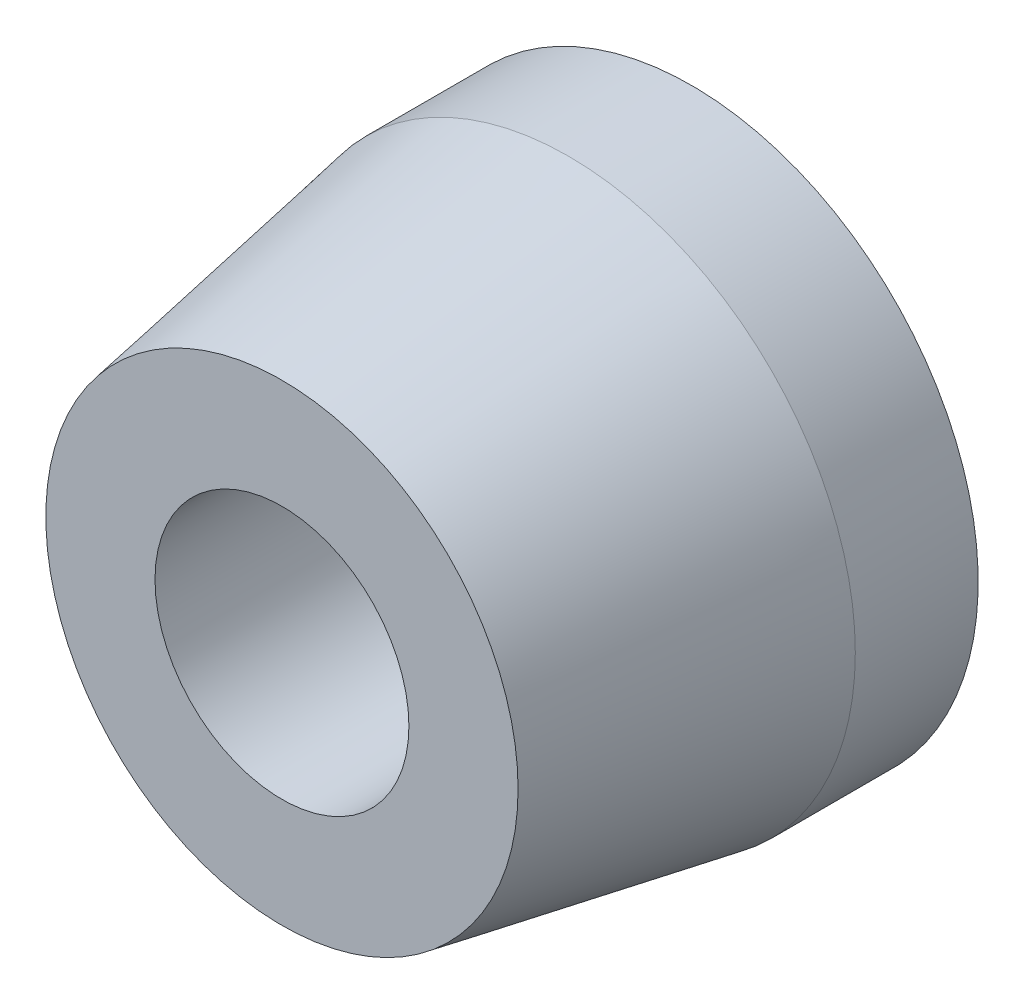
ISO-10303-21;
HEADER;
FILE_DESCRIPTION(('STEP AP214'),'2;1');
FILE_NAME('part.step','',(''),(''),'','','');
FILE_SCHEMA(('AUTOMOTIVE_DESIGN { 1 0 10303 214 1 1 1 1 }'));
ENDSEC;
DATA;
#1=APPLICATION_CONTEXT('core data for automotive mechanical design processes');
#2=APPLICATION_PROTOCOL_DEFINITION('international standard','automotive_design',2000,#1);
#3=PRODUCT_CONTEXT('',#1,'mechanical');
#4=PRODUCT('Part','Part','',(#3));
#5=PRODUCT_RELATED_PRODUCT_CATEGORY('part','',(#4));
#6=PRODUCT_DEFINITION_FORMATION('','',#4);
#7=PRODUCT_DEFINITION_CONTEXT('part definition',#1,'design');
#8=PRODUCT_DEFINITION('design','',#6,#7);
#9=PRODUCT_DEFINITION_SHAPE('','',#8);
#10=(LENGTH_UNIT() NAMED_UNIT(*) SI_UNIT(.MILLI.,.METRE.));
#11=(NAMED_UNIT(*) PLANE_ANGLE_UNIT() SI_UNIT($,.RADIAN.));
#12=(NAMED_UNIT(*) SI_UNIT($,.STERADIAN.) SOLID_ANGLE_UNIT());
#13=UNCERTAINTY_MEASURE_WITH_UNIT(LENGTH_MEASURE(1.E-05),#10,'distance_accuracy_value','');
#14=(GEOMETRIC_REPRESENTATION_CONTEXT(3) GLOBAL_UNCERTAINTY_ASSIGNED_CONTEXT((#13)) GLOBAL_UNIT_ASSIGNED_CONTEXT((#10,
#11,#12)) REPRESENTATION_CONTEXT('',''));
#15=CARTESIAN_POINT('',(0.,0.,0.));
#16=DIRECTION('',(0.,0.,1.));
#17=DIRECTION('',(1.,0.,0.));
#18=AXIS2_PLACEMENT_3D('',#15,#16,#17);
#19=CARTESIAN_POINT('',(0.,0.,-3.));
#20=DIRECTION('',(0.,0.,-1.));
#21=DIRECTION('',(-1.,0.,0.));
#22=AXIS2_PLACEMENT_3D('',#19,#20,#21);
#23=PLANE('',#22);
#24=CARTESIAN_POINT('',(0.,0.,-3.));
#25=DIRECTION('',(0.,0.,-1.));
#26=DIRECTION('',(-1.,0.,0.));
#27=AXIS2_PLACEMENT_3D('',#24,#25,#26);
#28=CIRCLE('',#27,7.);
#29=CARTESIAN_POINT('',(-7.,0.,-3.));
#30=VERTEX_POINT('',#29);
#31=EDGE_CURVE('E56',#30,#30,#28,.T.);
#32=ORIENTED_EDGE('',*,*,#31,.T.);
#33=EDGE_LOOP('',(#32));
#34=FACE_BOUND('',#33,.T.);
#35=CARTESIAN_POINT('',(0.,0.,-3.));
#36=DIRECTION('',(0.,0.,-1.));
#37=DIRECTION('',(-1.,0.,0.));
#38=AXIS2_PLACEMENT_3D('',#35,#36,#37);
#39=CIRCLE('',#38,2.5);
#40=CARTESIAN_POINT('',(-2.5,0.,-3.));
#41=VERTEX_POINT('',#40);
#42=EDGE_CURVE('E70',#41,#41,#39,.T.);
#43=ORIENTED_EDGE('',*,*,#42,.F.);
#44=EDGE_LOOP('',(#43));
#45=FACE_BOUND('',#44,.T.);
#46=ADVANCED_FACE('F37',(#34,#45),#23,.T.);
#47=CARTESIAN_POINT('',(0.,0.,0.));
#48=DIRECTION('',(0.,0.,-1.));
#49=DIRECTION('',(1.,0.,0.));
#50=AXIS2_PLACEMENT_3D('',#47,#48,#49);
#51=CONICAL_SURFACE('',#50,7.,0.174532925199433);
#52=CARTESIAN_POINT('',(0.,0.,7.));
#53=DIRECTION('',(0.,0.,1.));
#54=DIRECTION('',(1.,0.,0.));
#55=AXIS2_PLACEMENT_3D('',#52,#53,#54);
#56=CIRCLE('',#55,5.76571113504074);
#57=CARTESIAN_POINT('',(5.76571113504074,0.,7.));
#58=VERTEX_POINT('',#57);
#59=EDGE_CURVE('E10',#58,#58,#56,.T.);
#60=ORIENTED_EDGE('',*,*,#59,.F.);
#61=EDGE_LOOP('',(#60));
#62=FACE_BOUND('',#61,.T.);
#63=CARTESIAN_POINT('',(0.,0.,0.));
#64=DIRECTION('',(0.,0.,-1.));
#65=DIRECTION('',(-1.,0.,0.));
#66=AXIS2_PLACEMENT_3D('',#63,#64,#65);
#67=CIRCLE('',#66,7.);
#68=CARTESIAN_POINT('',(-7.,0.,0.));
#69=VERTEX_POINT('',#68);
#70=EDGE_CURVE('E58',#69,#69,#67,.T.);
#71=ORIENTED_EDGE('',*,*,#70,.F.);
#72=EDGE_LOOP('',(#71));
#73=FACE_BOUND('',#72,.T.);
#74=ADVANCED_FACE('F39',(#62,#73),#51,.T.);
#75=CARTESIAN_POINT('',(0.,0.,7.));
#76=DIRECTION('',(0.,0.,1.));
#77=DIRECTION('',(1.,0.,0.));
#78=AXIS2_PLACEMENT_3D('',#75,#76,#77);
#79=PLANE('',#78);
#80=CARTESIAN_POINT('',(0.,0.,7.));
#81=DIRECTION('',(0.,0.,1.));
#82=DIRECTION('',(1.,0.,0.));
#83=AXIS2_PLACEMENT_3D('',#80,#81,#82);
#84=CIRCLE('',#83,3.1);
#85=CARTESIAN_POINT('',(3.1,0.,7.));
#86=VERTEX_POINT('',#85);
#87=EDGE_CURVE('E45',#86,#86,#84,.T.);
#88=ORIENTED_EDGE('',*,*,#87,.F.);
#89=EDGE_LOOP('',(#88));
#90=FACE_BOUND('',#89,.T.);
#91=ORIENTED_EDGE('',*,*,#59,.T.);
#92=EDGE_LOOP('',(#91));
#93=FACE_BOUND('',#92,.T.);
#94=ADVANCED_FACE('F104',(#90,#93),#79,.T.);
#95=CARTESIAN_POINT('',(0.,0.,-8.76812408671319));
#96=DIRECTION('',(0.,0.,1.));
#97=DIRECTION('',(1.,0.,0.));
#98=AXIS2_PLACEMENT_3D('',#95,#96,#97);
#99=CYLINDRICAL_SURFACE('',#98,3.1);
#100=CARTESIAN_POINT('',(0.,0.,0.));
#101=DIRECTION('',(0.,0.,1.));
#102=DIRECTION('',(1.,0.,0.));
#103=AXIS2_PLACEMENT_3D('',#100,#101,#102);
#104=CIRCLE('',#103,3.1);
#105=CARTESIAN_POINT('',(3.1,0.,0.));
#106=VERTEX_POINT('',#105);
#107=EDGE_CURVE('E50',#106,#106,#104,.F.);
#108=ORIENTED_EDGE('',*,*,#107,.T.);
#109=EDGE_LOOP('',(#108));
#110=FACE_BOUND('',#109,.T.);
#111=ORIENTED_EDGE('',*,*,#87,.T.);
#112=EDGE_LOOP('',(#111));
#113=FACE_BOUND('',#112,.T.);
#114=ADVANCED_FACE('F111',(#110,#113),#99,.F.);
#115=CARTESIAN_POINT('',(0.,0.,0.));
#116=DIRECTION('',(0.,0.,-1.));
#117=DIRECTION('',(-1.,0.,0.));
#118=AXIS2_PLACEMENT_3D('',#115,#116,#117);
#119=PLANE('',#118);
#120=CARTESIAN_POINT('',(0.,0.,0.));
#121=DIRECTION('',(0.,0.,-1.));
#122=DIRECTION('',(-1.,0.,0.));
#123=AXIS2_PLACEMENT_3D('',#120,#121,#122);
#124=CIRCLE('',#123,1.65);
#125=CARTESIAN_POINT('',(-1.65,0.,0.));
#126=VERTEX_POINT('',#125);
#127=EDGE_CURVE('E62',#126,#126,#124,.T.);
#128=ORIENTED_EDGE('',*,*,#127,.T.);
#129=EDGE_LOOP('',(#128));
#130=FACE_BOUND('',#129,.T.);
#131=ORIENTED_EDGE('',*,*,#107,.F.);
#132=EDGE_LOOP('',(#131));
#133=FACE_BOUND('',#132,.T.);
#134=ADVANCED_FACE('F108',(#130,#133),#119,.F.);
#135=CARTESIAN_POINT('',(0.,0.,-3.));
#136=DIRECTION('',(0.,0.,1.));
#137=DIRECTION('',(1.,0.,0.));
#138=AXIS2_PLACEMENT_3D('',#135,#136,#137);
#139=CYLINDRICAL_SURFACE('',#138,7.);
#140=ORIENTED_EDGE('',*,*,#31,.F.);
#141=EDGE_LOOP('',(#140));
#142=FACE_BOUND('',#141,.T.);
#143=ORIENTED_EDGE('',*,*,#70,.T.);
#144=EDGE_LOOP('',(#143));
#145=FACE_BOUND('',#144,.T.);
#146=ADVANCED_FACE('F95',(#142,#145),#139,.T.);
#147=CARTESIAN_POINT('',(0.,0.,-3.));
#148=DIRECTION('',(0.,0.,1.));
#149=DIRECTION('',(1.,0.,0.));
#150=AXIS2_PLACEMENT_3D('',#147,#148,#149);
#151=CYLINDRICAL_SURFACE('',#150,1.65);
#152=ORIENTED_EDGE('',*,*,#127,.F.);
#153=EDGE_LOOP('',(#152));
#154=FACE_BOUND('',#153,.T.);
#155=CARTESIAN_POINT('',(0.,0.,-4.8));
#156=DIRECTION('',(0.,0.,-1.));
#157=DIRECTION('',(-1.,0.,0.));
#158=AXIS2_PLACEMENT_3D('',#155,#156,#157);
#159=CIRCLE('',#158,1.65);
#160=CARTESIAN_POINT('',(-1.65,0.,-4.8));
#161=VERTEX_POINT('',#160);
#162=EDGE_CURVE('E74',#161,#161,#159,.T.);
#163=ORIENTED_EDGE('',*,*,#162,.T.);
#164=EDGE_LOOP('',(#163));
#165=FACE_BOUND('',#164,.T.);
#166=ADVANCED_FACE('F82',(#154,#165),#151,.F.);
#167=CARTESIAN_POINT('',(0.,0.,-4.8));
#168=DIRECTION('',(0.,0.,-1.));
#169=DIRECTION('',(-1.,0.,0.));
#170=AXIS2_PLACEMENT_3D('',#167,#168,#169);
#171=PLANE('',#170);
#172=CARTESIAN_POINT('',(0.,0.,-4.8));
#173=DIRECTION('',(0.,0.,-1.));
#174=DIRECTION('',(-1.,0.,0.));
#175=AXIS2_PLACEMENT_3D('',#172,#173,#174);
#176=CIRCLE('',#175,2.5);
#177=CARTESIAN_POINT('',(-2.5,0.,-4.8));
#178=VERTEX_POINT('',#177);
#179=EDGE_CURVE('E69',#178,#178,#176,.T.);
#180=ORIENTED_EDGE('',*,*,#179,.T.);
#181=EDGE_LOOP('',(#180));
#182=FACE_BOUND('',#181,.T.);
#183=ORIENTED_EDGE('',*,*,#162,.F.);
#184=EDGE_LOOP('',(#183));
#185=FACE_BOUND('',#184,.T.);
#186=ADVANCED_FACE('F84',(#182,#185),#171,.T.);
#187=CARTESIAN_POINT('',(0.,0.,-4.8));
#188=DIRECTION('',(0.,0.,1.));
#189=DIRECTION('',(1.,0.,0.));
#190=AXIS2_PLACEMENT_3D('',#187,#188,#189);
#191=CYLINDRICAL_SURFACE('',#190,2.5);
#192=ORIENTED_EDGE('',*,*,#179,.F.);
#193=EDGE_LOOP('',(#192));
#194=FACE_BOUND('',#193,.T.);
#195=ORIENTED_EDGE('',*,*,#42,.T.);
#196=EDGE_LOOP('',(#195));
#197=FACE_BOUND('',#196,.T.);
#198=ADVANCED_FACE('F86',(#194,#197),#191,.T.);
#199=CLOSED_SHELL('',(#46,#74,#94,#114,#134,#146,#166,#186,#198));
#200=MANIFOLD_SOLID_BREP('B2',#199);
#201=ADVANCED_BREP_SHAPE_REPRESENTATION('',(#18,#200),#14);
#202=SHAPE_DEFINITION_REPRESENTATION(#9,#201);
ENDSEC;
END-ISO-10303-21;
